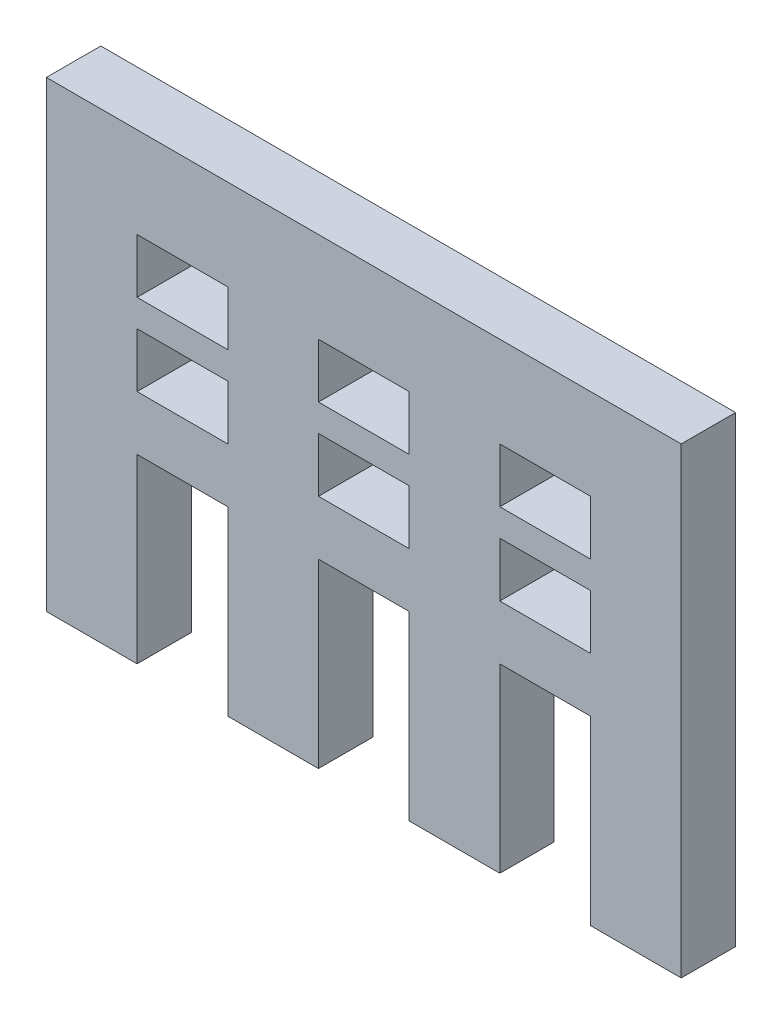
ISO-10303-21;
HEADER;
FILE_DESCRIPTION(('STEP AP214'),'2;1');
FILE_NAME('part.step','',(''),(''),'','','');
FILE_SCHEMA(('AUTOMOTIVE_DESIGN { 1 0 10303 214 1 1 1 1 }'));
ENDSEC;
DATA;
#1=APPLICATION_CONTEXT('core data for automotive mechanical design processes');
#2=APPLICATION_PROTOCOL_DEFINITION('international standard','automotive_design',2000,#1);
#3=PRODUCT_CONTEXT('',#1,'mechanical');
#4=PRODUCT('Part','Part','',(#3));
#5=PRODUCT_RELATED_PRODUCT_CATEGORY('part','',(#4));
#6=PRODUCT_DEFINITION_FORMATION('','',#4);
#7=PRODUCT_DEFINITION_CONTEXT('part definition',#1,'design');
#8=PRODUCT_DEFINITION('design','',#6,#7);
#9=PRODUCT_DEFINITION_SHAPE('','',#8);
#10=(LENGTH_UNIT() NAMED_UNIT(*) SI_UNIT(.MILLI.,.METRE.));
#11=(NAMED_UNIT(*) PLANE_ANGLE_UNIT() SI_UNIT($,.RADIAN.));
#12=(NAMED_UNIT(*) SI_UNIT($,.STERADIAN.) SOLID_ANGLE_UNIT());
#13=UNCERTAINTY_MEASURE_WITH_UNIT(LENGTH_MEASURE(1.E-05),#10,'distance_accuracy_value','');
#14=(GEOMETRIC_REPRESENTATION_CONTEXT(3) GLOBAL_UNCERTAINTY_ASSIGNED_CONTEXT((#13)) GLOBAL_UNIT_ASSIGNED_CONTEXT((#10,
#11,#12)) REPRESENTATION_CONTEXT('',''));
#15=CARTESIAN_POINT('',(0.,0.,0.));
#16=DIRECTION('',(0.,0.,1.));
#17=DIRECTION('',(1.,0.,0.));
#18=AXIS2_PLACEMENT_3D('',#15,#16,#17);
#19=CARTESIAN_POINT('',(0.,6.,3.));
#20=DIRECTION('',(0.,1.,0.));
#21=DIRECTION('',(0.,0.,1.));
#22=AXIS2_PLACEMENT_3D('',#19,#20,#21);
#23=PLANE('',#22);
#24=DIRECTION('',(1.,0.,0.));
#25=VECTOR('',#24,1.);
#26=CARTESIAN_POINT('',(0.,6.,0.));
#27=LINE('',#26,#25);
#28=CARTESIAN_POINT('',(-30.,6.,0.));
#29=VERTEX_POINT('',#28);
#30=CARTESIAN_POINT('',(-25.,6.,0.));
#31=VERTEX_POINT('',#30);
#32=EDGE_CURVE('E577',#29,#31,#27,.T.);
#33=ORIENTED_EDGE('',*,*,#32,.T.);
#34=DIRECTION('',(0.,0.,-1.));
#35=VECTOR('',#34,1.);
#36=CARTESIAN_POINT('',(-25.,6.,3.));
#37=LINE('',#36,#35);
#38=CARTESIAN_POINT('',(-25.,6.,3.));
#39=VERTEX_POINT('',#38);
#40=EDGE_CURVE('E11',#39,#31,#37,.T.);
#41=ORIENTED_EDGE('',*,*,#40,.F.);
#42=DIRECTION('',(1.,0.,0.));
#43=VECTOR('',#42,1.);
#44=CARTESIAN_POINT('',(0.,6.,3.));
#45=LINE('',#44,#43);
#46=CARTESIAN_POINT('',(-30.,6.,3.));
#47=VERTEX_POINT('',#46);
#48=EDGE_CURVE('E312',#47,#39,#45,.T.);
#49=ORIENTED_EDGE('',*,*,#48,.F.);
#50=DIRECTION('',(0.,0.,-1.));
#51=VECTOR('',#50,1.);
#52=CARTESIAN_POINT('',(-30.,6.,3.));
#53=LINE('',#52,#51);
#54=EDGE_CURVE('E408',#47,#29,#53,.T.);
#55=ORIENTED_EDGE('',*,*,#54,.T.);
#56=EDGE_LOOP('',(#33,#41,#49,#55));
#57=FACE_BOUND('',#56,.T.);
#58=ADVANCED_FACE('F35',(#57),#23,.F.);
#59=CARTESIAN_POINT('',(-25.,0.,3.));
#60=DIRECTION('',(-1.,0.,0.));
#61=DIRECTION('',(0.,0.,1.));
#62=AXIS2_PLACEMENT_3D('',#59,#60,#61);
#63=PLANE('',#62);
#64=DIRECTION('',(0.,1.,0.));
#65=VECTOR('',#64,1.);
#66=CARTESIAN_POINT('',(-25.,0.,0.));
#67=LINE('',#66,#65);
#68=CARTESIAN_POINT('',(-25.,3.,0.));
#69=VERTEX_POINT('',#68);
#70=EDGE_CURVE('E303',#69,#31,#67,.T.);
#71=ORIENTED_EDGE('',*,*,#70,.F.);
#72=DIRECTION('',(0.,0.,-1.));
#73=VECTOR('',#72,1.);
#74=CARTESIAN_POINT('',(-25.,3.,3.));
#75=LINE('',#74,#73);
#76=CARTESIAN_POINT('',(-25.,3.,3.));
#77=VERTEX_POINT('',#76);
#78=EDGE_CURVE('E45',#77,#69,#75,.T.);
#79=ORIENTED_EDGE('',*,*,#78,.F.);
#80=DIRECTION('',(0.,1.,0.));
#81=VECTOR('',#80,1.);
#82=CARTESIAN_POINT('',(-25.,0.,3.));
#83=LINE('',#82,#81);
#84=EDGE_CURVE('E301',#77,#39,#83,.T.);
#85=ORIENTED_EDGE('',*,*,#84,.T.);
#86=ORIENTED_EDGE('',*,*,#40,.T.);
#87=EDGE_LOOP('',(#71,#79,#85,#86));
#88=FACE_BOUND('',#87,.T.);
#89=ADVANCED_FACE('F300',(#88),#63,.T.);
#90=CARTESIAN_POINT('',(0.,3.,3.));
#91=DIRECTION('',(0.,1.,0.));
#92=DIRECTION('',(-1.,0.,0.));
#93=AXIS2_PLACEMENT_3D('',#90,#91,#92);
#94=PLANE('',#93);
#95=DIRECTION('',(1.,0.,0.));
#96=VECTOR('',#95,1.);
#97=CARTESIAN_POINT('',(0.,3.,0.));
#98=LINE('',#97,#96);
#99=CARTESIAN_POINT('',(-30.,3.,0.));
#100=VERTEX_POINT('',#99);
#101=EDGE_CURVE('E400',#100,#69,#98,.T.);
#102=ORIENTED_EDGE('',*,*,#101,.F.);
#103=DIRECTION('',(0.,0.,-1.));
#104=VECTOR('',#103,1.);
#105=CARTESIAN_POINT('',(-30.,3.,3.));
#106=LINE('',#105,#104);
#107=CARTESIAN_POINT('',(-30.,3.,3.));
#108=VERTEX_POINT('',#107);
#109=EDGE_CURVE('E177',#108,#100,#106,.T.);
#110=ORIENTED_EDGE('',*,*,#109,.F.);
#111=DIRECTION('',(1.,0.,0.));
#112=VECTOR('',#111,1.);
#113=CARTESIAN_POINT('',(0.,3.,3.));
#114=LINE('',#113,#112);
#115=EDGE_CURVE('E310',#108,#77,#114,.T.);
#116=ORIENTED_EDGE('',*,*,#115,.T.);
#117=ORIENTED_EDGE('',*,*,#78,.T.);
#118=EDGE_LOOP('',(#102,#110,#116,#117));
#119=FACE_BOUND('',#118,.T.);
#120=ADVANCED_FACE('F315',(#119),#94,.T.);
#121=CARTESIAN_POINT('',(-20.,0.,3.));
#122=DIRECTION('',(-1.,0.,0.));
#123=DIRECTION('',(0.,0.,1.));
#124=AXIS2_PLACEMENT_3D('',#121,#122,#123);
#125=PLANE('',#124);
#126=DIRECTION('',(0.,1.,0.));
#127=VECTOR('',#126,1.);
#128=CARTESIAN_POINT('',(-20.,0.,0.));
#129=LINE('',#128,#127);
#130=CARTESIAN_POINT('',(-20.,3.,0.));
#131=VERTEX_POINT('',#130);
#132=CARTESIAN_POINT('',(-20.,6.,0.));
#133=VERTEX_POINT('',#132);
#134=EDGE_CURVE('E582',#131,#133,#129,.T.);
#135=ORIENTED_EDGE('',*,*,#134,.T.);
#136=DIRECTION('',(0.,0.,-1.));
#137=VECTOR('',#136,1.);
#138=CARTESIAN_POINT('',(-20.,6.,3.));
#139=LINE('',#138,#137);
#140=CARTESIAN_POINT('',(-20.,6.,3.));
#141=VERTEX_POINT('',#140);
#142=EDGE_CURVE('E410',#141,#133,#139,.T.);
#143=ORIENTED_EDGE('',*,*,#142,.F.);
#144=DIRECTION('',(0.,1.,0.));
#145=VECTOR('',#144,1.);
#146=CARTESIAN_POINT('',(-20.,0.,3.));
#147=LINE('',#146,#145);
#148=CARTESIAN_POINT('',(-20.,3.,3.));
#149=VERTEX_POINT('',#148);
#150=EDGE_CURVE('E326',#149,#141,#147,.T.);
#151=ORIENTED_EDGE('',*,*,#150,.F.);
#152=DIRECTION('',(0.,0.,-1.));
#153=VECTOR('',#152,1.);
#154=CARTESIAN_POINT('',(-20.,3.,3.));
#155=LINE('',#154,#153);
#156=EDGE_CURVE('E412',#149,#131,#155,.T.);
#157=ORIENTED_EDGE('',*,*,#156,.T.);
#158=EDGE_LOOP('',(#135,#143,#151,#157));
#159=FACE_BOUND('',#158,.T.);
#160=ADVANCED_FACE('F620',(#159),#125,.F.);
#161=CARTESIAN_POINT('',(-15.,6.,0.));
#162=VERTEX_POINT('',#161);
#163=EDGE_CURVE('E578',#133,#162,#27,.T.);
#164=ORIENTED_EDGE('',*,*,#163,.T.);
#165=DIRECTION('',(0.,0.,-1.));
#166=VECTOR('',#165,1.);
#167=CARTESIAN_POINT('',(-15.,6.,3.));
#168=LINE('',#167,#166);
#169=CARTESIAN_POINT('',(-15.,6.,3.));
#170=VERTEX_POINT('',#169);
#171=EDGE_CURVE('E417',#170,#162,#168,.T.);
#172=ORIENTED_EDGE('',*,*,#171,.F.);
#173=EDGE_CURVE('E331',#141,#170,#45,.T.);
#174=ORIENTED_EDGE('',*,*,#173,.F.);
#175=ORIENTED_EDGE('',*,*,#142,.T.);
#176=EDGE_LOOP('',(#164,#172,#174,#175));
#177=FACE_BOUND('',#176,.T.);
#178=ADVANCED_FACE('F608',(#177),#23,.F.);
#179=CARTESIAN_POINT('',(-15.,0.,3.));
#180=DIRECTION('',(-1.,0.,0.));
#181=DIRECTION('',(0.,0.,1.));
#182=AXIS2_PLACEMENT_3D('',#179,#180,#181);
#183=PLANE('',#182);
#184=DIRECTION('',(0.,1.,0.));
#185=VECTOR('',#184,1.);
#186=CARTESIAN_POINT('',(-15.,0.,0.));
#187=LINE('',#186,#185);
#188=CARTESIAN_POINT('',(-15.,3.,0.));
#189=VERTEX_POINT('',#188);
#190=EDGE_CURVE('E584',#189,#162,#187,.T.);
#191=ORIENTED_EDGE('',*,*,#190,.F.);
#192=DIRECTION('',(0.,0.,-1.));
#193=VECTOR('',#192,1.);
#194=CARTESIAN_POINT('',(-15.,3.,3.));
#195=LINE('',#194,#193);
#196=CARTESIAN_POINT('',(-15.,3.,3.));
#197=VERTEX_POINT('',#196);
#198=EDGE_CURVE('E414',#197,#189,#195,.T.);
#199=ORIENTED_EDGE('',*,*,#198,.F.);
#200=DIRECTION('',(0.,1.,0.));
#201=VECTOR('',#200,1.);
#202=CARTESIAN_POINT('',(-15.,0.,3.));
#203=LINE('',#202,#201);
#204=EDGE_CURVE('E324',#197,#170,#203,.T.);
#205=ORIENTED_EDGE('',*,*,#204,.T.);
#206=ORIENTED_EDGE('',*,*,#171,.T.);
#207=EDGE_LOOP('',(#191,#199,#205,#206));
#208=FACE_BOUND('',#207,.T.);
#209=ADVANCED_FACE('F619',(#208),#183,.T.);
#210=CARTESIAN_POINT('',(-10.,0.,3.));
#211=DIRECTION('',(-1.,0.,0.));
#212=DIRECTION('',(0.,0.,1.));
#213=AXIS2_PLACEMENT_3D('',#210,#211,#212);
#214=PLANE('',#213);
#215=DIRECTION('',(0.,1.,0.));
#216=VECTOR('',#215,1.);
#217=CARTESIAN_POINT('',(-10.,0.,0.));
#218=LINE('',#217,#216);
#219=CARTESIAN_POINT('',(-10.,3.,0.));
#220=VERTEX_POINT('',#219);
#221=CARTESIAN_POINT('',(-10.,6.,0.));
#222=VERTEX_POINT('',#221);
#223=EDGE_CURVE('E570',#220,#222,#218,.T.);
#224=ORIENTED_EDGE('',*,*,#223,.T.);
#225=DIRECTION('',(0.,0.,-1.));
#226=VECTOR('',#225,1.);
#227=CARTESIAN_POINT('',(-10.,6.,3.));
#228=LINE('',#227,#226);
#229=CARTESIAN_POINT('',(-10.,6.,3.));
#230=VERTEX_POINT('',#229);
#231=EDGE_CURVE('E415',#230,#222,#228,.T.);
#232=ORIENTED_EDGE('',*,*,#231,.F.);
#233=DIRECTION('',(0.,1.,0.));
#234=VECTOR('',#233,1.);
#235=CARTESIAN_POINT('',(-10.,0.,3.));
#236=LINE('',#235,#234);
#237=CARTESIAN_POINT('',(-10.,3.,3.));
#238=VERTEX_POINT('',#237);
#239=EDGE_CURVE('E336',#238,#230,#236,.T.);
#240=ORIENTED_EDGE('',*,*,#239,.F.);
#241=DIRECTION('',(0.,0.,-1.));
#242=VECTOR('',#241,1.);
#243=CARTESIAN_POINT('',(-10.,3.,3.));
#244=LINE('',#243,#242);
#245=EDGE_CURVE('E421',#238,#220,#244,.T.);
#246=ORIENTED_EDGE('',*,*,#245,.T.);
#247=EDGE_LOOP('',(#224,#232,#240,#246));
#248=FACE_BOUND('',#247,.T.);
#249=ADVANCED_FACE('F616',(#248),#214,.F.);
#250=CARTESIAN_POINT('',(-5.,6.,0.));
#251=VERTEX_POINT('',#250);
#252=EDGE_CURVE('E573',#222,#251,#27,.T.);
#253=ORIENTED_EDGE('',*,*,#252,.T.);
#254=DIRECTION('',(0.,0.,-1.));
#255=VECTOR('',#254,1.);
#256=CARTESIAN_POINT('',(-5.,6.,3.));
#257=LINE('',#256,#255);
#258=CARTESIAN_POINT('',(-5.,6.,3.));
#259=VERTEX_POINT('',#258);
#260=EDGE_CURVE('E426',#259,#251,#257,.T.);
#261=ORIENTED_EDGE('',*,*,#260,.F.);
#262=EDGE_CURVE('E333',#230,#259,#45,.T.);
#263=ORIENTED_EDGE('',*,*,#262,.F.);
#264=ORIENTED_EDGE('',*,*,#231,.T.);
#265=EDGE_LOOP('',(#253,#261,#263,#264));
#266=FACE_BOUND('',#265,.T.);
#267=ADVANCED_FACE('F607',(#266),#23,.F.);
#268=CARTESIAN_POINT('',(-5.,0.,3.));
#269=DIRECTION('',(-1.,0.,0.));
#270=DIRECTION('',(0.,0.,1.));
#271=AXIS2_PLACEMENT_3D('',#268,#269,#270);
#272=PLANE('',#271);
#273=DIRECTION('',(0.,1.,0.));
#274=VECTOR('',#273,1.);
#275=CARTESIAN_POINT('',(-5.,0.,0.));
#276=LINE('',#275,#274);
#277=CARTESIAN_POINT('',(-5.,3.,0.));
#278=VERTEX_POINT('',#277);
#279=EDGE_CURVE('E576',#278,#251,#276,.T.);
#280=ORIENTED_EDGE('',*,*,#279,.F.);
#281=DIRECTION('',(0.,0.,-1.));
#282=VECTOR('',#281,1.);
#283=CARTESIAN_POINT('',(-5.,3.,3.));
#284=LINE('',#283,#282);
#285=CARTESIAN_POINT('',(-5.,3.,3.));
#286=VERTEX_POINT('',#285);
#287=EDGE_CURVE('E423',#286,#278,#284,.T.);
#288=ORIENTED_EDGE('',*,*,#287,.F.);
#289=DIRECTION('',(0.,1.,0.));
#290=VECTOR('',#289,1.);
#291=CARTESIAN_POINT('',(-5.,0.,3.));
#292=LINE('',#291,#290);
#293=EDGE_CURVE('E327',#286,#259,#292,.T.);
#294=ORIENTED_EDGE('',*,*,#293,.T.);
#295=ORIENTED_EDGE('',*,*,#260,.T.);
#296=EDGE_LOOP('',(#280,#288,#294,#295));
#297=FACE_BOUND('',#296,.T.);
#298=ADVANCED_FACE('F615',(#297),#272,.T.);
#299=CARTESIAN_POINT('',(0.,10.5,3.));
#300=DIRECTION('',(0.,1.,0.));
#301=DIRECTION('',(0.,0.,1.));
#302=AXIS2_PLACEMENT_3D('',#299,#300,#301);
#303=PLANE('',#302);
#304=DIRECTION('',(1.,0.,0.));
#305=VECTOR('',#304,1.);
#306=CARTESIAN_POINT('',(0.,10.5,0.));
#307=LINE('',#306,#305);
#308=CARTESIAN_POINT('',(-30.,10.5,0.));
#309=VERTEX_POINT('',#308);
#310=CARTESIAN_POINT('',(-25.,10.5,0.));
#311=VERTEX_POINT('',#310);
#312=EDGE_CURVE('E550',#309,#311,#307,.T.);
#313=ORIENTED_EDGE('',*,*,#312,.T.);
#314=DIRECTION('',(0.,0.,-1.));
#315=VECTOR('',#314,1.);
#316=CARTESIAN_POINT('',(-25.,10.5,3.));
#317=LINE('',#316,#315);
#318=CARTESIAN_POINT('',(-25.,10.5,3.));
#319=VERTEX_POINT('',#318);
#320=EDGE_CURVE('E424',#319,#311,#317,.T.);
#321=ORIENTED_EDGE('',*,*,#320,.F.);
#322=DIRECTION('',(1.,0.,0.));
#323=VECTOR('',#322,1.);
#324=CARTESIAN_POINT('',(0.,10.5,3.));
#325=LINE('',#324,#323);
#326=CARTESIAN_POINT('',(-30.,10.5,3.));
#327=VERTEX_POINT('',#326);
#328=EDGE_CURVE('E347',#327,#319,#325,.T.);
#329=ORIENTED_EDGE('',*,*,#328,.F.);
#330=DIRECTION('',(0.,0.,-1.));
#331=VECTOR('',#330,1.);
#332=CARTESIAN_POINT('',(-30.,10.5,3.));
#333=LINE('',#332,#331);
#334=EDGE_CURVE('E430',#327,#309,#333,.T.);
#335=ORIENTED_EDGE('',*,*,#334,.T.);
#336=EDGE_LOOP('',(#313,#321,#329,#335));
#337=FACE_BOUND('',#336,.T.);
#338=ADVANCED_FACE('F637',(#337),#303,.F.);
#339=CARTESIAN_POINT('',(-25.,0.,3.));
#340=DIRECTION('',(-1.,0.,0.));
#341=DIRECTION('',(0.,0.,1.));
#342=AXIS2_PLACEMENT_3D('',#339,#340,#341);
#343=PLANE('',#342);
#344=DIRECTION('',(0.,1.,0.));
#345=VECTOR('',#344,1.);
#346=CARTESIAN_POINT('',(-25.,0.,0.));
#347=LINE('',#346,#345);
#348=CARTESIAN_POINT('',(-25.,7.5,0.));
#349=VERTEX_POINT('',#348);
#350=EDGE_CURVE('E565',#349,#311,#347,.T.);
#351=ORIENTED_EDGE('',*,*,#350,.F.);
#352=DIRECTION('',(0.,0.,-1.));
#353=VECTOR('',#352,1.);
#354=CARTESIAN_POINT('',(-25.,7.5,3.));
#355=LINE('',#354,#353);
#356=CARTESIAN_POINT('',(-25.,7.5,3.));
#357=VERTEX_POINT('',#356);
#358=EDGE_CURVE('E436',#357,#349,#355,.T.);
#359=ORIENTED_EDGE('',*,*,#358,.F.);
#360=DIRECTION('',(0.,1.,0.));
#361=VECTOR('',#360,1.);
#362=CARTESIAN_POINT('',(-25.,0.,3.));
#363=LINE('',#362,#361);
#364=EDGE_CURVE('E344',#357,#319,#363,.T.);
#365=ORIENTED_EDGE('',*,*,#364,.T.);
#366=ORIENTED_EDGE('',*,*,#320,.T.);
#367=EDGE_LOOP('',(#351,#359,#365,#366));
#368=FACE_BOUND('',#367,.T.);
#369=ADVANCED_FACE('F650',(#368),#343,.T.);
#370=CARTESIAN_POINT('',(0.,7.5,3.));
#371=DIRECTION('',(0.,1.,0.));
#372=DIRECTION('',(0.,0.,1.));
#373=AXIS2_PLACEMENT_3D('',#370,#371,#372);
#374=PLANE('',#373);
#375=DIRECTION('',(1.,0.,0.));
#376=VECTOR('',#375,1.);
#377=CARTESIAN_POINT('',(0.,7.5,0.));
#378=LINE('',#377,#376);
#379=CARTESIAN_POINT('',(-30.,7.5,0.));
#380=VERTEX_POINT('',#379);
#381=EDGE_CURVE('E558',#380,#349,#378,.T.);
#382=ORIENTED_EDGE('',*,*,#381,.F.);
#383=DIRECTION('',(0.,0.,-1.));
#384=VECTOR('',#383,1.);
#385=CARTESIAN_POINT('',(-30.,7.5,3.));
#386=LINE('',#385,#384);
#387=CARTESIAN_POINT('',(-30.,7.5,3.));
#388=VERTEX_POINT('',#387);
#389=EDGE_CURVE('E433',#388,#380,#386,.T.);
#390=ORIENTED_EDGE('',*,*,#389,.F.);
#391=DIRECTION('',(1.,0.,0.));
#392=VECTOR('',#391,1.);
#393=CARTESIAN_POINT('',(0.,7.5,3.));
#394=LINE('',#393,#392);
#395=EDGE_CURVE('E343',#388,#357,#394,.T.);
#396=ORIENTED_EDGE('',*,*,#395,.T.);
#397=ORIENTED_EDGE('',*,*,#358,.T.);
#398=EDGE_LOOP('',(#382,#390,#396,#397));
#399=FACE_BOUND('',#398,.T.);
#400=ADVANCED_FACE('F646',(#399),#374,.T.);
#401=CARTESIAN_POINT('',(-20.,0.,3.));
#402=DIRECTION('',(-1.,0.,0.));
#403=DIRECTION('',(0.,0.,1.));
#404=AXIS2_PLACEMENT_3D('',#401,#402,#403);
#405=PLANE('',#404);
#406=DIRECTION('',(0.,1.,0.));
#407=VECTOR('',#406,1.);
#408=CARTESIAN_POINT('',(-20.,0.,0.));
#409=LINE('',#408,#407);
#410=CARTESIAN_POINT('',(-20.,7.5,0.));
#411=VERTEX_POINT('',#410);
#412=CARTESIAN_POINT('',(-20.,10.5,0.));
#413=VERTEX_POINT('',#412);
#414=EDGE_CURVE('E557',#411,#413,#409,.T.);
#415=ORIENTED_EDGE('',*,*,#414,.T.);
#416=DIRECTION('',(0.,0.,-1.));
#417=VECTOR('',#416,1.);
#418=CARTESIAN_POINT('',(-20.,10.5,3.));
#419=LINE('',#418,#417);
#420=CARTESIAN_POINT('',(-20.,10.5,3.));
#421=VERTEX_POINT('',#420);
#422=EDGE_CURVE('E434',#421,#413,#419,.T.);
#423=ORIENTED_EDGE('',*,*,#422,.F.);
#424=DIRECTION('',(0.,1.,0.));
#425=VECTOR('',#424,1.);
#426=CARTESIAN_POINT('',(-20.,0.,3.));
#427=LINE('',#426,#425);
#428=CARTESIAN_POINT('',(-20.,7.5,3.));
#429=VERTEX_POINT('',#428);
#430=EDGE_CURVE('E353',#429,#421,#427,.T.);
#431=ORIENTED_EDGE('',*,*,#430,.F.);
#432=DIRECTION('',(0.,0.,-1.));
#433=VECTOR('',#432,1.);
#434=CARTESIAN_POINT('',(-20.,7.5,3.));
#435=LINE('',#434,#433);
#436=EDGE_CURVE('E439',#429,#411,#435,.T.);
#437=ORIENTED_EDGE('',*,*,#436,.T.);
#438=EDGE_LOOP('',(#415,#423,#431,#437));
#439=FACE_BOUND('',#438,.T.);
#440=ADVANCED_FACE('F649',(#439),#405,.F.);
#441=CARTESIAN_POINT('',(-15.,10.5,0.));
#442=VERTEX_POINT('',#441);
#443=EDGE_CURVE('E551',#413,#442,#307,.T.);
#444=ORIENTED_EDGE('',*,*,#443,.T.);
#445=DIRECTION('',(0.,0.,-1.));
#446=VECTOR('',#445,1.);
#447=CARTESIAN_POINT('',(-15.,10.5,3.));
#448=LINE('',#447,#446);
#449=CARTESIAN_POINT('',(-15.,10.5,3.));
#450=VERTEX_POINT('',#449);
#451=EDGE_CURVE('E444',#450,#442,#448,.T.);
#452=ORIENTED_EDGE('',*,*,#451,.F.);
#453=EDGE_CURVE('E352',#421,#450,#325,.T.);
#454=ORIENTED_EDGE('',*,*,#453,.F.);
#455=ORIENTED_EDGE('',*,*,#422,.T.);
#456=EDGE_LOOP('',(#444,#452,#454,#455));
#457=FACE_BOUND('',#456,.T.);
#458=ADVANCED_FACE('F660',(#457),#303,.F.);
#459=CARTESIAN_POINT('',(-15.,0.,3.));
#460=DIRECTION('',(-1.,0.,0.));
#461=DIRECTION('',(0.,0.,1.));
#462=AXIS2_PLACEMENT_3D('',#459,#460,#461);
#463=PLANE('',#462);
#464=DIRECTION('',(0.,1.,0.));
#465=VECTOR('',#464,1.);
#466=CARTESIAN_POINT('',(-15.,0.,0.));
#467=LINE('',#466,#465);
#468=CARTESIAN_POINT('',(-15.,7.5,0.));
#469=VERTEX_POINT('',#468);
#470=EDGE_CURVE('E562',#469,#442,#467,.T.);
#471=ORIENTED_EDGE('',*,*,#470,.F.);
#472=DIRECTION('',(0.,0.,-1.));
#473=VECTOR('',#472,1.);
#474=CARTESIAN_POINT('',(-15.,7.5,3.));
#475=LINE('',#474,#473);
#476=CARTESIAN_POINT('',(-15.,7.5,3.));
#477=VERTEX_POINT('',#476);
#478=EDGE_CURVE('E441',#477,#469,#475,.T.);
#479=ORIENTED_EDGE('',*,*,#478,.F.);
#480=DIRECTION('',(0.,1.,0.));
#481=VECTOR('',#480,1.);
#482=CARTESIAN_POINT('',(-15.,0.,3.));
#483=LINE('',#482,#481);
#484=EDGE_CURVE('E348',#477,#450,#483,.T.);
#485=ORIENTED_EDGE('',*,*,#484,.T.);
#486=ORIENTED_EDGE('',*,*,#451,.T.);
#487=EDGE_LOOP('',(#471,#479,#485,#486));
#488=FACE_BOUND('',#487,.T.);
#489=ADVANCED_FACE('F661',(#488),#463,.T.);
#490=CARTESIAN_POINT('',(-10.,0.,3.));
#491=DIRECTION('',(-1.,0.,0.));
#492=DIRECTION('',(0.,0.,1.));
#493=AXIS2_PLACEMENT_3D('',#490,#491,#492);
#494=PLANE('',#493);
#495=DIRECTION('',(0.,1.,0.));
#496=VECTOR('',#495,1.);
#497=CARTESIAN_POINT('',(-10.,0.,0.));
#498=LINE('',#497,#496);
#499=CARTESIAN_POINT('',(-10.,7.5,0.));
#500=VERTEX_POINT('',#499);
#501=CARTESIAN_POINT('',(-10.,10.5,0.));
#502=VERTEX_POINT('',#501);
#503=EDGE_CURVE('E543',#500,#502,#498,.T.);
#504=ORIENTED_EDGE('',*,*,#503,.T.);
#505=DIRECTION('',(0.,0.,-1.));
#506=VECTOR('',#505,1.);
#507=CARTESIAN_POINT('',(-10.,10.5,3.));
#508=LINE('',#507,#506);
#509=CARTESIAN_POINT('',(-10.,10.5,3.));
#510=VERTEX_POINT('',#509);
#511=EDGE_CURVE('E442',#510,#502,#508,.T.);
#512=ORIENTED_EDGE('',*,*,#511,.F.);
#513=DIRECTION('',(0.,1.,0.));
#514=VECTOR('',#513,1.);
#515=CARTESIAN_POINT('',(-10.,0.,3.));
#516=LINE('',#515,#514);
#517=CARTESIAN_POINT('',(-10.,7.5,3.));
#518=VERTEX_POINT('',#517);
#519=EDGE_CURVE('E364',#518,#510,#516,.T.);
#520=ORIENTED_EDGE('',*,*,#519,.F.);
#521=DIRECTION('',(0.,0.,-1.));
#522=VECTOR('',#521,1.);
#523=CARTESIAN_POINT('',(-10.,7.5,3.));
#524=LINE('',#523,#522);
#525=EDGE_CURVE('E448',#518,#500,#524,.T.);
#526=ORIENTED_EDGE('',*,*,#525,.T.);
#527=EDGE_LOOP('',(#504,#512,#520,#526));
#528=FACE_BOUND('',#527,.T.);
#529=ADVANCED_FACE('F664',(#528),#494,.F.);
#530=CARTESIAN_POINT('',(-5.,10.5,0.));
#531=VERTEX_POINT('',#530);
#532=EDGE_CURVE('E546',#502,#531,#307,.T.);
#533=ORIENTED_EDGE('',*,*,#532,.T.);
#534=DIRECTION('',(0.,0.,-1.));
#535=VECTOR('',#534,1.);
#536=CARTESIAN_POINT('',(-5.,10.5,3.));
#537=LINE('',#536,#535);
#538=CARTESIAN_POINT('',(-5.,10.5,3.));
#539=VERTEX_POINT('',#538);
#540=EDGE_CURVE('E452',#539,#531,#537,.T.);
#541=ORIENTED_EDGE('',*,*,#540,.F.);
#542=EDGE_CURVE('E362',#510,#539,#325,.T.);
#543=ORIENTED_EDGE('',*,*,#542,.F.);
#544=ORIENTED_EDGE('',*,*,#511,.T.);
#545=EDGE_LOOP('',(#533,#541,#543,#544));
#546=FACE_BOUND('',#545,.T.);
#547=ADVANCED_FACE('F659',(#546),#303,.F.);
#548=CARTESIAN_POINT('',(-5.,0.,3.));
#549=DIRECTION('',(-1.,0.,0.));
#550=DIRECTION('',(0.,0.,1.));
#551=AXIS2_PLACEMENT_3D('',#548,#549,#550);
#552=PLANE('',#551);
#553=DIRECTION('',(0.,1.,0.));
#554=VECTOR('',#553,1.);
#555=CARTESIAN_POINT('',(-5.,0.,0.));
#556=LINE('',#555,#554);
#557=CARTESIAN_POINT('',(-5.,7.5,0.));
#558=VERTEX_POINT('',#557);
#559=EDGE_CURVE('E549',#558,#531,#556,.T.);
#560=ORIENTED_EDGE('',*,*,#559,.F.);
#561=DIRECTION('',(0.,0.,-1.));
#562=VECTOR('',#561,1.);
#563=CARTESIAN_POINT('',(-5.,7.5,3.));
#564=LINE('',#563,#562);
#565=CARTESIAN_POINT('',(-5.,7.5,3.));
#566=VERTEX_POINT('',#565);
#567=EDGE_CURVE('E450',#566,#558,#564,.T.);
#568=ORIENTED_EDGE('',*,*,#567,.F.);
#569=DIRECTION('',(0.,1.,0.));
#570=VECTOR('',#569,1.);
#571=CARTESIAN_POINT('',(-5.,0.,3.));
#572=LINE('',#571,#570);
#573=EDGE_CURVE('E359',#566,#539,#572,.T.);
#574=ORIENTED_EDGE('',*,*,#573,.T.);
#575=ORIENTED_EDGE('',*,*,#540,.T.);
#576=EDGE_LOOP('',(#560,#568,#574,#575));
#577=FACE_BOUND('',#576,.T.);
#578=ADVANCED_FACE('F669',(#577),#552,.T.);
#579=CARTESIAN_POINT('',(0.,0.,3.));
#580=DIRECTION('',(1.,0.,0.));
#581=DIRECTION('',(0.,1.,0.));
#582=AXIS2_PLACEMENT_3D('',#579,#580,#581);
#583=PLANE('',#582);
#584=DIRECTION('',(0.,-1.,0.));
#585=VECTOR('',#584,1.);
#586=CARTESIAN_POINT('',(0.,0.,0.));
#587=LINE('',#586,#585);
#588=CARTESIAN_POINT('',(0.,15.5,0.));
#589=VERTEX_POINT('',#588);
#590=CARTESIAN_POINT('',(0.,-10.,0.));
#591=VERTEX_POINT('',#590);
#592=EDGE_CURVE('E500',#589,#591,#587,.T.);
#593=ORIENTED_EDGE('',*,*,#592,.F.);
#594=DIRECTION('',(0.,0.,-1.));
#595=VECTOR('',#594,1.);
#596=CARTESIAN_POINT('',(0.,15.5,3.));
#597=LINE('',#596,#595);
#598=CARTESIAN_POINT('',(0.,15.5,3.));
#599=VERTEX_POINT('',#598);
#600=EDGE_CURVE('E39',#599,#589,#597,.T.);
#601=ORIENTED_EDGE('',*,*,#600,.F.);
#602=DIRECTION('',(0.,-1.,0.));
#603=VECTOR('',#602,1.);
#604=CARTESIAN_POINT('',(0.,0.,3.));
#605=LINE('',#604,#603);
#606=CARTESIAN_POINT('',(0.,-10.,3.));
#607=VERTEX_POINT('',#606);
#608=EDGE_CURVE('E399',#599,#607,#605,.T.);
#609=ORIENTED_EDGE('',*,*,#608,.T.);
#610=DIRECTION('',(0.,0.,-1.));
#611=VECTOR('',#610,1.);
#612=CARTESIAN_POINT('',(0.,-10.,3.));
#613=LINE('',#612,#611);
#614=EDGE_CURVE('E319',#607,#591,#613,.T.);
#615=ORIENTED_EDGE('',*,*,#614,.T.);
#616=EDGE_LOOP('',(#593,#601,#609,#615));
#617=FACE_BOUND('',#616,.T.);
#618=ADVANCED_FACE('F37',(#617),#583,.T.);
#619=CARTESIAN_POINT('',(0.,15.5,3.));
#620=DIRECTION('',(0.,1.,0.));
#621=DIRECTION('',(0.,0.,1.));
#622=AXIS2_PLACEMENT_3D('',#619,#620,#621);
#623=PLANE('',#622);
#624=DIRECTION('',(1.,0.,0.));
#625=VECTOR('',#624,1.);
#626=CARTESIAN_POINT('',(0.,15.5,0.));
#627=LINE('',#626,#625);
#628=CARTESIAN_POINT('',(-35.,15.5,0.));
#629=VERTEX_POINT('',#628);
#630=EDGE_CURVE('E497',#629,#589,#627,.T.);
#631=ORIENTED_EDGE('',*,*,#630,.F.);
#632=DIRECTION('',(0.,0.,-1.));
#633=VECTOR('',#632,1.);
#634=CARTESIAN_POINT('',(-35.,15.5,3.));
#635=LINE('',#634,#633);
#636=CARTESIAN_POINT('',(-35.,15.5,3.));
#637=VERTEX_POINT('',#636);
#638=EDGE_CURVE('E489',#637,#629,#635,.T.);
#639=ORIENTED_EDGE('',*,*,#638,.F.);
#640=DIRECTION('',(1.,0.,0.));
#641=VECTOR('',#640,1.);
#642=CARTESIAN_POINT('',(0.,15.5,3.));
#643=LINE('',#642,#641);
#644=EDGE_CURVE('E396',#637,#599,#643,.T.);
#645=ORIENTED_EDGE('',*,*,#644,.T.);
#646=ORIENTED_EDGE('',*,*,#600,.T.);
#647=EDGE_LOOP('',(#631,#639,#645,#646));
#648=FACE_BOUND('',#647,.T.);
#649=ADVANCED_FACE('F495',(#648),#623,.T.);
#650=CARTESIAN_POINT('',(-35.,0.,3.));
#651=DIRECTION('',(1.,0.,0.));
#652=DIRECTION('',(0.,1.,0.));
#653=AXIS2_PLACEMENT_3D('',#650,#651,#652);
#654=PLANE('',#653);
#655=DIRECTION('',(0.,-1.,0.));
#656=VECTOR('',#655,1.);
#657=CARTESIAN_POINT('',(-35.,0.,0.));
#658=LINE('',#657,#656);
#659=CARTESIAN_POINT('',(-35.,-10.,0.));
#660=VERTEX_POINT('',#659);
#661=EDGE_CURVE('E509',#629,#660,#658,.T.);
#662=ORIENTED_EDGE('',*,*,#661,.T.);
#663=DIRECTION('',(0.,0.,-1.));
#664=VECTOR('',#663,1.);
#665=CARTESIAN_POINT('',(-35.,-10.,3.));
#666=LINE('',#665,#664);
#667=CARTESIAN_POINT('',(-35.,-10.,3.));
#668=VERTEX_POINT('',#667);
#669=EDGE_CURVE('E487',#668,#660,#666,.T.);
#670=ORIENTED_EDGE('',*,*,#669,.F.);
#671=DIRECTION('',(0.,-1.,0.));
#672=VECTOR('',#671,1.);
#673=CARTESIAN_POINT('',(-35.,0.,3.));
#674=LINE('',#673,#672);
#675=EDGE_CURVE('E394',#637,#668,#674,.T.);
#676=ORIENTED_EDGE('',*,*,#675,.F.);
#677=ORIENTED_EDGE('',*,*,#638,.T.);
#678=EDGE_LOOP('',(#662,#670,#676,#677));
#679=FACE_BOUND('',#678,.T.);
#680=ADVANCED_FACE('F721',(#679),#654,.F.);
#681=CARTESIAN_POINT('',(0.,-10.,3.));
#682=DIRECTION('',(0.,1.,0.));
#683=DIRECTION('',(0.,0.,1.));
#684=AXIS2_PLACEMENT_3D('',#681,#682,#683);
#685=PLANE('',#684);
#686=DIRECTION('',(1.,0.,0.));
#687=VECTOR('',#686,1.);
#688=CARTESIAN_POINT('',(0.,-10.,0.));
#689=LINE('',#688,#687);
#690=CARTESIAN_POINT('',(-30.,-10.,0.));
#691=VERTEX_POINT('',#690);
#692=EDGE_CURVE('E511',#660,#691,#689,.T.);
#693=ORIENTED_EDGE('',*,*,#692,.T.);
#694=DIRECTION('',(0.,0.,-1.));
#695=VECTOR('',#694,1.);
#696=CARTESIAN_POINT('',(-30.,-10.,3.));
#697=LINE('',#696,#695);
#698=CARTESIAN_POINT('',(-30.,-10.,3.));
#699=VERTEX_POINT('',#698);
#700=EDGE_CURVE('E485',#699,#691,#697,.T.);
#701=ORIENTED_EDGE('',*,*,#700,.F.);
#702=DIRECTION('',(1.,0.,0.));
#703=VECTOR('',#702,1.);
#704=CARTESIAN_POINT('',(0.,-10.,3.));
#705=LINE('',#704,#703);
#706=EDGE_CURVE('E392',#668,#699,#705,.T.);
#707=ORIENTED_EDGE('',*,*,#706,.F.);
#708=ORIENTED_EDGE('',*,*,#669,.T.);
#709=EDGE_LOOP('',(#693,#701,#707,#708));
#710=FACE_BOUND('',#709,.T.);
#711=ADVANCED_FACE('F717',(#710),#685,.F.);
#712=CARTESIAN_POINT('',(-30.,0.,3.));
#713=DIRECTION('',(1.,0.,0.));
#714=DIRECTION('',(0.,0.,-1.));
#715=AXIS2_PLACEMENT_3D('',#712,#713,#714);
#716=PLANE('',#715);
#717=DIRECTION('',(0.,-1.,0.));
#718=VECTOR('',#717,1.);
#719=CARTESIAN_POINT('',(-30.,0.,0.));
#720=LINE('',#719,#718);
#721=CARTESIAN_POINT('',(-30.,0.,0.));
#722=VERTEX_POINT('',#721);
#723=EDGE_CURVE('E516',#722,#691,#720,.T.);
#724=ORIENTED_EDGE('',*,*,#723,.F.);
#725=DIRECTION('',(0.,0.,-1.));
#726=VECTOR('',#725,1.);
#727=CARTESIAN_POINT('',(-30.,0.,3.));
#728=LINE('',#727,#726);
#729=CARTESIAN_POINT('',(-30.,0.,3.));
#730=VERTEX_POINT('',#729);
#731=EDGE_CURVE('E483',#730,#722,#728,.T.);
#732=ORIENTED_EDGE('',*,*,#731,.F.);
#733=DIRECTION('',(0.,-1.,0.));
#734=VECTOR('',#733,1.);
#735=CARTESIAN_POINT('',(-30.,0.,3.));
#736=LINE('',#735,#734);
#737=EDGE_CURVE('E389',#730,#699,#736,.T.);
#738=ORIENTED_EDGE('',*,*,#737,.T.);
#739=ORIENTED_EDGE('',*,*,#700,.T.);
#740=EDGE_LOOP('',(#724,#732,#738,#739));
#741=FACE_BOUND('',#740,.T.);
#742=ADVANCED_FACE('F714',(#741),#716,.T.);
#743=CARTESIAN_POINT('',(0.,0.,3.));
#744=DIRECTION('',(0.,1.,0.));
#745=DIRECTION('',(0.,0.,1.));
#746=AXIS2_PLACEMENT_3D('',#743,#744,#745);
#747=PLANE('',#746);
#748=DIRECTION('',(1.,0.,0.));
#749=VECTOR('',#748,1.);
#750=CARTESIAN_POINT('',(0.,0.,0.));
#751=LINE('',#750,#749);
#752=CARTESIAN_POINT('',(-25.,0.,0.));
#753=VERTEX_POINT('',#752);
#754=EDGE_CURVE('E519',#722,#753,#751,.T.);
#755=ORIENTED_EDGE('',*,*,#754,.T.);
#756=DIRECTION('',(0.,0.,-1.));
#757=VECTOR('',#756,1.);
#758=CARTESIAN_POINT('',(-25.,0.,3.));
#759=LINE('',#758,#757);
#760=CARTESIAN_POINT('',(-25.,0.,3.));
#761=VERTEX_POINT('',#760);
#762=EDGE_CURVE('E480',#761,#753,#759,.T.);
#763=ORIENTED_EDGE('',*,*,#762,.F.);
#764=DIRECTION('',(1.,0.,0.));
#765=VECTOR('',#764,1.);
#766=CARTESIAN_POINT('',(0.,0.,3.));
#767=LINE('',#766,#765);
#768=EDGE_CURVE('E387',#730,#761,#767,.T.);
#769=ORIENTED_EDGE('',*,*,#768,.F.);
#770=ORIENTED_EDGE('',*,*,#731,.T.);
#771=EDGE_LOOP('',(#755,#763,#769,#770));
#772=FACE_BOUND('',#771,.T.);
#773=ADVANCED_FACE('F689',(#772),#747,.F.);
#774=CARTESIAN_POINT('',(-25.,0.,3.));
#775=DIRECTION('',(1.,0.,0.));
#776=DIRECTION('',(0.,1.,0.));
#777=AXIS2_PLACEMENT_3D('',#774,#775,#776);
#778=PLANE('',#777);
#779=DIRECTION('',(0.,-1.,0.));
#780=VECTOR('',#779,1.);
#781=CARTESIAN_POINT('',(-25.,0.,0.));
#782=LINE('',#781,#780);
#783=CARTESIAN_POINT('',(-25.,-10.,0.));
#784=VERTEX_POINT('',#783);
#785=EDGE_CURVE('E521',#753,#784,#782,.T.);
#786=ORIENTED_EDGE('',*,*,#785,.T.);
#787=DIRECTION('',(0.,0.,-1.));
#788=VECTOR('',#787,1.);
#789=CARTESIAN_POINT('',(-25.,-10.,3.));
#790=LINE('',#789,#788);
#791=CARTESIAN_POINT('',(-25.,-10.,3.));
#792=VERTEX_POINT('',#791);
#793=EDGE_CURVE('E477',#792,#784,#790,.T.);
#794=ORIENTED_EDGE('',*,*,#793,.F.);
#795=DIRECTION('',(0.,-1.,0.));
#796=VECTOR('',#795,1.);
#797=CARTESIAN_POINT('',(-25.,0.,3.));
#798=LINE('',#797,#796);
#799=EDGE_CURVE('E385',#761,#792,#798,.T.);
#800=ORIENTED_EDGE('',*,*,#799,.F.);
#801=ORIENTED_EDGE('',*,*,#762,.T.);
#802=EDGE_LOOP('',(#786,#794,#800,#801));
#803=FACE_BOUND('',#802,.T.);
#804=ADVANCED_FACE('F709',(#803),#778,.F.);
#805=CARTESIAN_POINT('',(0.,-10.,3.));
#806=DIRECTION('',(0.,1.,0.));
#807=DIRECTION('',(0.,0.,1.));
#808=AXIS2_PLACEMENT_3D('',#805,#806,#807);
#809=PLANE('',#808);
#810=DIRECTION('',(1.,0.,0.));
#811=VECTOR('',#810,1.);
#812=CARTESIAN_POINT('',(0.,-10.,0.));
#813=LINE('',#812,#811);
#814=CARTESIAN_POINT('',(-20.,-10.,0.));
#815=VERTEX_POINT('',#814);
#816=EDGE_CURVE('E525',#784,#815,#813,.T.);
#817=ORIENTED_EDGE('',*,*,#816,.T.);
#818=DIRECTION('',(0.,0.,-1.));
#819=VECTOR('',#818,1.);
#820=CARTESIAN_POINT('',(-20.,-10.,3.));
#821=LINE('',#820,#819);
#822=CARTESIAN_POINT('',(-20.,-10.,3.));
#823=VERTEX_POINT('',#822);
#824=EDGE_CURVE('E475',#823,#815,#821,.T.);
#825=ORIENTED_EDGE('',*,*,#824,.F.);
#826=DIRECTION('',(1.,0.,0.));
#827=VECTOR('',#826,1.);
#828=CARTESIAN_POINT('',(0.,-10.,3.));
#829=LINE('',#828,#827);
#830=EDGE_CURVE('E383',#792,#823,#829,.T.);
#831=ORIENTED_EDGE('',*,*,#830,.F.);
#832=ORIENTED_EDGE('',*,*,#793,.T.);
#833=EDGE_LOOP('',(#817,#825,#831,#832));
#834=FACE_BOUND('',#833,.T.);
#835=ADVANCED_FACE('F705',(#834),#809,.F.);
#836=CARTESIAN_POINT('',(-20.,0.,3.));
#837=DIRECTION('',(1.,0.,0.));
#838=DIRECTION('',(0.,0.,-1.));
#839=AXIS2_PLACEMENT_3D('',#836,#837,#838);
#840=PLANE('',#839);
#841=DIRECTION('',(0.,-1.,0.));
#842=VECTOR('',#841,1.);
#843=CARTESIAN_POINT('',(-20.,0.,0.));
#844=LINE('',#843,#842);
#845=CARTESIAN_POINT('',(-20.,0.,0.));
#846=VERTEX_POINT('',#845);
#847=EDGE_CURVE('E528',#846,#815,#844,.T.);
#848=ORIENTED_EDGE('',*,*,#847,.F.);
#849=DIRECTION('',(0.,0.,-1.));
#850=VECTOR('',#849,1.);
#851=CARTESIAN_POINT('',(-20.,0.,3.));
#852=LINE('',#851,#850);
#853=CARTESIAN_POINT('',(-20.,0.,3.));
#854=VERTEX_POINT('',#853);
#855=EDGE_CURVE('E473',#854,#846,#852,.T.);
#856=ORIENTED_EDGE('',*,*,#855,.F.);
#857=DIRECTION('',(0.,-1.,0.));
#858=VECTOR('',#857,1.);
#859=CARTESIAN_POINT('',(-20.,0.,3.));
#860=LINE('',#859,#858);
#861=EDGE_CURVE('E380',#854,#823,#860,.T.);
#862=ORIENTED_EDGE('',*,*,#861,.T.);
#863=ORIENTED_EDGE('',*,*,#824,.T.);
#864=EDGE_LOOP('',(#848,#856,#862,#863));
#865=FACE_BOUND('',#864,.T.);
#866=ADVANCED_FACE('F702',(#865),#840,.T.);
#867=CARTESIAN_POINT('',(-15.,0.,0.));
#868=VERTEX_POINT('',#867);
#869=EDGE_CURVE('E523',#846,#868,#751,.T.);
#870=ORIENTED_EDGE('',*,*,#869,.T.);
#871=DIRECTION('',(0.,0.,-1.));
#872=VECTOR('',#871,1.);
#873=CARTESIAN_POINT('',(-15.,0.,3.));
#874=LINE('',#873,#872);
#875=CARTESIAN_POINT('',(-15.,0.,3.));
#876=VERTEX_POINT('',#875);
#877=EDGE_CURVE('E470',#876,#868,#874,.T.);
#878=ORIENTED_EDGE('',*,*,#877,.F.);
#879=EDGE_CURVE('E379',#854,#876,#767,.T.);
#880=ORIENTED_EDGE('',*,*,#879,.F.);
#881=ORIENTED_EDGE('',*,*,#855,.T.);
#882=EDGE_LOOP('',(#870,#878,#880,#881));
#883=FACE_BOUND('',#882,.T.);
#884=ADVANCED_FACE('F690',(#883),#747,.F.);
#885=CARTESIAN_POINT('',(-15.,0.,3.));
#886=DIRECTION('',(1.,0.,0.));
#887=DIRECTION('',(0.,1.,0.));
#888=AXIS2_PLACEMENT_3D('',#885,#886,#887);
#889=PLANE('',#888);
#890=DIRECTION('',(0.,-1.,0.));
#891=VECTOR('',#890,1.);
#892=CARTESIAN_POINT('',(-15.,0.,0.));
#893=LINE('',#892,#891);
#894=CARTESIAN_POINT('',(-15.,-10.,0.));
#895=VERTEX_POINT('',#894);
#896=EDGE_CURVE('E531',#868,#895,#893,.T.);
#897=ORIENTED_EDGE('',*,*,#896,.T.);
#898=DIRECTION('',(0.,0.,-1.));
#899=VECTOR('',#898,1.);
#900=CARTESIAN_POINT('',(-15.,-10.,3.));
#901=LINE('',#900,#899);
#902=CARTESIAN_POINT('',(-15.,-10.,3.));
#903=VERTEX_POINT('',#902);
#904=EDGE_CURVE('E467',#903,#895,#901,.T.);
#905=ORIENTED_EDGE('',*,*,#904,.F.);
#906=DIRECTION('',(0.,-1.,0.));
#907=VECTOR('',#906,1.);
#908=CARTESIAN_POINT('',(-15.,0.,3.));
#909=LINE('',#908,#907);
#910=EDGE_CURVE('E377',#876,#903,#909,.T.);
#911=ORIENTED_EDGE('',*,*,#910,.F.);
#912=ORIENTED_EDGE('',*,*,#877,.T.);
#913=EDGE_LOOP('',(#897,#905,#911,#912));
#914=FACE_BOUND('',#913,.T.);
#915=ADVANCED_FACE('F697',(#914),#889,.F.);
#916=CARTESIAN_POINT('',(0.,-10.,3.));
#917=DIRECTION('',(0.,1.,0.));
#918=DIRECTION('',(0.,0.,1.));
#919=AXIS2_PLACEMENT_3D('',#916,#917,#918);
#920=PLANE('',#919);
#921=DIRECTION('',(1.,0.,0.));
#922=VECTOR('',#921,1.);
#923=CARTESIAN_POINT('',(0.,-10.,0.));
#924=LINE('',#923,#922);
#925=CARTESIAN_POINT('',(-10.,-10.,0.));
#926=VERTEX_POINT('',#925);
#927=EDGE_CURVE('E533',#895,#926,#924,.T.);
#928=ORIENTED_EDGE('',*,*,#927,.T.);
#929=DIRECTION('',(0.,0.,-1.));
#930=VECTOR('',#929,1.);
#931=CARTESIAN_POINT('',(-10.,-10.,3.));
#932=LINE('',#931,#930);
#933=CARTESIAN_POINT('',(-10.,-10.,3.));
#934=VERTEX_POINT('',#933);
#935=EDGE_CURVE('E465',#934,#926,#932,.T.);
#936=ORIENTED_EDGE('',*,*,#935,.F.);
#937=DIRECTION('',(1.,0.,0.));
#938=VECTOR('',#937,1.);
#939=CARTESIAN_POINT('',(0.,-10.,3.));
#940=LINE('',#939,#938);
#941=EDGE_CURVE('E375',#903,#934,#940,.T.);
#942=ORIENTED_EDGE('',*,*,#941,.F.);
#943=ORIENTED_EDGE('',*,*,#904,.T.);
#944=EDGE_LOOP('',(#928,#936,#942,#943));
#945=FACE_BOUND('',#944,.T.);
#946=ADVANCED_FACE('F693',(#945),#920,.F.);
#947=CARTESIAN_POINT('',(-10.,0.,3.));
#948=DIRECTION('',(1.,0.,0.));
#949=DIRECTION('',(0.,0.,-1.));
#950=AXIS2_PLACEMENT_3D('',#947,#948,#949);
#951=PLANE('',#950);
#952=DIRECTION('',(0.,-1.,0.));
#953=VECTOR('',#952,1.);
#954=CARTESIAN_POINT('',(-10.,0.,0.));
#955=LINE('',#954,#953);
#956=CARTESIAN_POINT('',(-10.,0.,0.));
#957=VERTEX_POINT('',#956);
#958=EDGE_CURVE('E536',#957,#926,#955,.T.);
#959=ORIENTED_EDGE('',*,*,#958,.F.);
#960=DIRECTION('',(0.,0.,-1.));
#961=VECTOR('',#960,1.);
#962=CARTESIAN_POINT('',(-10.,0.,3.));
#963=LINE('',#962,#961);
#964=CARTESIAN_POINT('',(-10.,0.,3.));
#965=VERTEX_POINT('',#964);
#966=EDGE_CURVE('E463',#965,#957,#963,.T.);
#967=ORIENTED_EDGE('',*,*,#966,.F.);
#968=DIRECTION('',(0.,-1.,0.));
#969=VECTOR('',#968,1.);
#970=CARTESIAN_POINT('',(-10.,0.,3.));
#971=LINE('',#970,#969);
#972=EDGE_CURVE('E372',#965,#934,#971,.T.);
#973=ORIENTED_EDGE('',*,*,#972,.T.);
#974=ORIENTED_EDGE('',*,*,#935,.T.);
#975=EDGE_LOOP('',(#959,#967,#973,#974));
#976=FACE_BOUND('',#975,.T.);
#977=ADVANCED_FACE('F687',(#976),#951,.T.);
#978=CARTESIAN_POINT('',(-5.,0.,0.));
#979=VERTEX_POINT('',#978);
#980=EDGE_CURVE('E522',#957,#979,#751,.T.);
#981=ORIENTED_EDGE('',*,*,#980,.T.);
#982=DIRECTION('',(0.,0.,-1.));
#983=VECTOR('',#982,1.);
#984=CARTESIAN_POINT('',(-5.,0.,3.));
#985=LINE('',#984,#983);
#986=CARTESIAN_POINT('',(-5.,0.,3.));
#987=VERTEX_POINT('',#986);
#988=EDGE_CURVE('E460',#987,#979,#985,.T.);
#989=ORIENTED_EDGE('',*,*,#988,.F.);
#990=EDGE_CURVE('E371',#965,#987,#767,.T.);
#991=ORIENTED_EDGE('',*,*,#990,.F.);
#992=ORIENTED_EDGE('',*,*,#966,.T.);
#993=EDGE_LOOP('',(#981,#989,#991,#992));
#994=FACE_BOUND('',#993,.T.);
#995=ADVANCED_FACE('F683',(#994),#747,.F.);
#996=CARTESIAN_POINT('',(-4.99999999999999,0.,3.));
#997=DIRECTION('',(1.,0.,0.));
#998=DIRECTION('',(0.,1.,0.));
#999=AXIS2_PLACEMENT_3D('',#996,#997,#998);
#1000=PLANE('',#999);
#1001=DIRECTION('',(0.,-1.,0.));
#1002=VECTOR('',#1001,1.);
#1003=CARTESIAN_POINT('',(-4.99999999999999,0.,0.));
#1004=LINE('',#1003,#1002);
#1005=CARTESIAN_POINT('',(-5.00000000000001,-10.,0.));
#1006=VERTEX_POINT('',#1005);
#1007=EDGE_CURVE('E539',#979,#1006,#1004,.T.);
#1008=ORIENTED_EDGE('',*,*,#1007,.T.);
#1009=DIRECTION('',(0.,0.,-1.));
#1010=VECTOR('',#1009,1.);
#1011=CARTESIAN_POINT('',(-5.00000000000001,-10.,3.));
#1012=LINE('',#1011,#1010);
#1013=CARTESIAN_POINT('',(-5.00000000000001,-10.,3.));
#1014=VERTEX_POINT('',#1013);
#1015=EDGE_CURVE('E457',#1014,#1006,#1012,.T.);
#1016=ORIENTED_EDGE('',*,*,#1015,.F.);
#1017=DIRECTION('',(0.,-1.,0.));
#1018=VECTOR('',#1017,1.);
#1019=CARTESIAN_POINT('',(-4.99999999999999,0.,3.));
#1020=LINE('',#1019,#1018);
#1021=EDGE_CURVE('E369',#987,#1014,#1020,.T.);
#1022=ORIENTED_EDGE('',*,*,#1021,.F.);
#1023=ORIENTED_EDGE('',*,*,#988,.T.);
#1024=EDGE_LOOP('',(#1008,#1016,#1022,#1023));
#1025=FACE_BOUND('',#1024,.T.);
#1026=ADVANCED_FACE('F680',(#1025),#1000,.F.);
#1027=EDGE_CURVE('E403',#131,#189,#98,.T.);
#1028=ORIENTED_EDGE('',*,*,#1027,.F.);
#1029=ORIENTED_EDGE('',*,*,#156,.F.);
#1030=EDGE_CURVE('E317',#149,#197,#114,.T.);
#1031=ORIENTED_EDGE('',*,*,#1030,.T.);
#1032=ORIENTED_EDGE('',*,*,#198,.T.);
#1033=EDGE_LOOP('',(#1028,#1029,#1031,#1032));
#1034=FACE_BOUND('',#1033,.T.);
#1035=ADVANCED_FACE('F633',(#1034),#94,.T.);
#1036=EDGE_CURVE('E404',#220,#278,#98,.T.);
#1037=ORIENTED_EDGE('',*,*,#1036,.F.);
#1038=ORIENTED_EDGE('',*,*,#245,.F.);
#1039=EDGE_CURVE('E318',#238,#286,#114,.T.);
#1040=ORIENTED_EDGE('',*,*,#1039,.T.);
#1041=ORIENTED_EDGE('',*,*,#287,.T.);
#1042=EDGE_LOOP('',(#1037,#1038,#1040,#1041));
#1043=FACE_BOUND('',#1042,.T.);
#1044=ADVANCED_FACE('F632',(#1043),#94,.T.);
#1045=CARTESIAN_POINT('',(-30.,0.,3.));
#1046=DIRECTION('',(-1.,0.,0.));
#1047=DIRECTION('',(0.,0.,1.));
#1048=AXIS2_PLACEMENT_3D('',#1045,#1046,#1047);
#1049=PLANE('',#1048);
#1050=DIRECTION('',(0.,1.,0.));
#1051=VECTOR('',#1050,1.);
#1052=CARTESIAN_POINT('',(-30.,0.,0.));
#1053=LINE('',#1052,#1051);
#1054=EDGE_CURVE('E568',#380,#309,#1053,.T.);
#1055=ORIENTED_EDGE('',*,*,#1054,.T.);
#1056=ORIENTED_EDGE('',*,*,#334,.F.);
#1057=DIRECTION('',(0.,1.,0.));
#1058=VECTOR('',#1057,1.);
#1059=CARTESIAN_POINT('',(-30.,0.,3.));
#1060=LINE('',#1059,#1058);
#1061=EDGE_CURVE('E341',#388,#327,#1060,.T.);
#1062=ORIENTED_EDGE('',*,*,#1061,.F.);
#1063=ORIENTED_EDGE('',*,*,#389,.T.);
#1064=EDGE_LOOP('',(#1055,#1056,#1062,#1063));
#1065=FACE_BOUND('',#1064,.T.);
#1066=ADVANCED_FACE('F641',(#1065),#1049,.F.);
#1067=EDGE_CURVE('E559',#411,#469,#378,.T.);
#1068=ORIENTED_EDGE('',*,*,#1067,.F.);
#1069=ORIENTED_EDGE('',*,*,#436,.F.);
#1070=EDGE_CURVE('E351',#429,#477,#394,.T.);
#1071=ORIENTED_EDGE('',*,*,#1070,.T.);
#1072=ORIENTED_EDGE('',*,*,#478,.T.);
#1073=EDGE_LOOP('',(#1068,#1069,#1071,#1072));
#1074=FACE_BOUND('',#1073,.T.);
#1075=ADVANCED_FACE('F644',(#1074),#374,.T.);
#1076=EDGE_CURVE('E554',#500,#558,#378,.T.);
#1077=ORIENTED_EDGE('',*,*,#1076,.F.);
#1078=ORIENTED_EDGE('',*,*,#525,.F.);
#1079=EDGE_CURVE('E356',#518,#566,#394,.T.);
#1080=ORIENTED_EDGE('',*,*,#1079,.T.);
#1081=ORIENTED_EDGE('',*,*,#567,.T.);
#1082=EDGE_LOOP('',(#1077,#1078,#1080,#1081));
#1083=FACE_BOUND('',#1082,.T.);
#1084=ADVANCED_FACE('F652',(#1083),#374,.T.);
#1085=CARTESIAN_POINT('',(0.,-10.,3.));
#1086=DIRECTION('',(0.,1.,0.));
#1087=DIRECTION('',(0.,0.,1.));
#1088=AXIS2_PLACEMENT_3D('',#1085,#1086,#1087);
#1089=PLANE('',#1088);
#1090=DIRECTION('',(1.,0.,0.));
#1091=VECTOR('',#1090,1.);
#1092=CARTESIAN_POINT('',(0.,-10.,0.));
#1093=LINE('',#1092,#1091);
#1094=EDGE_CURVE('E541',#1006,#591,#1093,.T.);
#1095=ORIENTED_EDGE('',*,*,#1094,.T.);
#1096=ORIENTED_EDGE('',*,*,#614,.F.);
#1097=DIRECTION('',(1.,0.,0.));
#1098=VECTOR('',#1097,1.);
#1099=CARTESIAN_POINT('',(0.,-10.,3.));
#1100=LINE('',#1099,#1098);
#1101=EDGE_CURVE('E367',#1014,#607,#1100,.T.);
#1102=ORIENTED_EDGE('',*,*,#1101,.F.);
#1103=ORIENTED_EDGE('',*,*,#1015,.T.);
#1104=EDGE_LOOP('',(#1095,#1096,#1102,#1103));
#1105=FACE_BOUND('',#1104,.T.);
#1106=ADVANCED_FACE('F676',(#1105),#1089,.F.);
#1107=CARTESIAN_POINT('',(-30.,0.,3.));
#1108=DIRECTION('',(-1.,0.,0.));
#1109=DIRECTION('',(0.,0.,1.));
#1110=AXIS2_PLACEMENT_3D('',#1107,#1108,#1109);
#1111=PLANE('',#1110);
#1112=DIRECTION('',(0.,1.,0.));
#1113=VECTOR('',#1112,1.);
#1114=CARTESIAN_POINT('',(-30.,0.,0.));
#1115=LINE('',#1114,#1113);
#1116=EDGE_CURVE('E180',#100,#29,#1115,.T.);
#1117=ORIENTED_EDGE('',*,*,#1116,.T.);
#1118=ORIENTED_EDGE('',*,*,#54,.F.);
#1119=DIRECTION('',(0.,1.,0.));
#1120=VECTOR('',#1119,1.);
#1121=CARTESIAN_POINT('',(-30.,0.,3.));
#1122=LINE('',#1121,#1120);
#1123=EDGE_CURVE('E54',#108,#47,#1122,.T.);
#1124=ORIENTED_EDGE('',*,*,#1123,.F.);
#1125=ORIENTED_EDGE('',*,*,#109,.T.);
#1126=EDGE_LOOP('',(#1117,#1118,#1124,#1125));
#1127=FACE_BOUND('',#1126,.T.);
#1128=ADVANCED_FACE('F601',(#1127),#1111,.F.);
#1129=CARTESIAN_POINT('',(0.,0.,3.));
#1130=DIRECTION('',(0.,0.,1.));
#1131=DIRECTION('',(1.,0.,0.));
#1132=AXIS2_PLACEMENT_3D('',#1129,#1130,#1131);
#1133=PLANE('',#1132);
#1134=ORIENTED_EDGE('',*,*,#608,.F.);
#1135=ORIENTED_EDGE('',*,*,#644,.F.);
#1136=ORIENTED_EDGE('',*,*,#675,.T.);
#1137=ORIENTED_EDGE('',*,*,#706,.T.);
#1138=ORIENTED_EDGE('',*,*,#737,.F.);
#1139=ORIENTED_EDGE('',*,*,#768,.T.);
#1140=ORIENTED_EDGE('',*,*,#799,.T.);
#1141=ORIENTED_EDGE('',*,*,#830,.T.);
#1142=ORIENTED_EDGE('',*,*,#861,.F.);
#1143=ORIENTED_EDGE('',*,*,#879,.T.);
#1144=ORIENTED_EDGE('',*,*,#910,.T.);
#1145=ORIENTED_EDGE('',*,*,#941,.T.);
#1146=ORIENTED_EDGE('',*,*,#972,.F.);
#1147=ORIENTED_EDGE('',*,*,#990,.T.);
#1148=ORIENTED_EDGE('',*,*,#1021,.T.);
#1149=ORIENTED_EDGE('',*,*,#1101,.T.);
#1150=EDGE_LOOP('',(#1134,#1135,#1136,#1137,#1138,#1139,#1140,#1141,#1142,#1143,#1144,#1145,
#1146,#1147,#1148,#1149));
#1151=FACE_BOUND('',#1150,.T.);
#1152=ORIENTED_EDGE('',*,*,#519,.T.);
#1153=ORIENTED_EDGE('',*,*,#542,.T.);
#1154=ORIENTED_EDGE('',*,*,#573,.F.);
#1155=ORIENTED_EDGE('',*,*,#1079,.F.);
#1156=EDGE_LOOP('',(#1152,#1153,#1154,#1155));
#1157=FACE_BOUND('',#1156,.T.);
#1158=ORIENTED_EDGE('',*,*,#430,.T.);
#1159=ORIENTED_EDGE('',*,*,#453,.T.);
#1160=ORIENTED_EDGE('',*,*,#484,.F.);
#1161=ORIENTED_EDGE('',*,*,#1070,.F.);
#1162=EDGE_LOOP('',(#1158,#1159,#1160,#1161));
#1163=FACE_BOUND('',#1162,.T.);
#1164=ORIENTED_EDGE('',*,*,#328,.T.);
#1165=ORIENTED_EDGE('',*,*,#364,.F.);
#1166=ORIENTED_EDGE('',*,*,#395,.F.);
#1167=ORIENTED_EDGE('',*,*,#1061,.T.);
#1168=EDGE_LOOP('',(#1164,#1165,#1166,#1167));
#1169=FACE_BOUND('',#1168,.T.);
#1170=ORIENTED_EDGE('',*,*,#239,.T.);
#1171=ORIENTED_EDGE('',*,*,#262,.T.);
#1172=ORIENTED_EDGE('',*,*,#293,.F.);
#1173=ORIENTED_EDGE('',*,*,#1039,.F.);
#1174=EDGE_LOOP('',(#1170,#1171,#1172,#1173));
#1175=FACE_BOUND('',#1174,.T.);
#1176=ORIENTED_EDGE('',*,*,#150,.T.);
#1177=ORIENTED_EDGE('',*,*,#173,.T.);
#1178=ORIENTED_EDGE('',*,*,#204,.F.);
#1179=ORIENTED_EDGE('',*,*,#1030,.F.);
#1180=EDGE_LOOP('',(#1176,#1177,#1178,#1179));
#1181=FACE_BOUND('',#1180,.T.);
#1182=ORIENTED_EDGE('',*,*,#48,.T.);
#1183=ORIENTED_EDGE('',*,*,#84,.F.);
#1184=ORIENTED_EDGE('',*,*,#115,.F.);
#1185=ORIENTED_EDGE('',*,*,#1123,.T.);
#1186=EDGE_LOOP('',(#1182,#1183,#1184,#1185));
#1187=FACE_BOUND('',#1186,.T.);
#1188=ADVANCED_FACE('F309',(#1151,#1157,#1163,#1169,#1175,#1181,#1187),#1133,.T.);
#1189=CARTESIAN_POINT('',(0.,0.,0.));
#1190=DIRECTION('',(0.,0.,1.));
#1191=DIRECTION('',(1.,0.,0.));
#1192=AXIS2_PLACEMENT_3D('',#1189,#1190,#1191);
#1193=PLANE('',#1192);
#1194=ORIENTED_EDGE('',*,*,#592,.T.);
#1195=ORIENTED_EDGE('',*,*,#1094,.F.);
#1196=ORIENTED_EDGE('',*,*,#1007,.F.);
#1197=ORIENTED_EDGE('',*,*,#980,.F.);
#1198=ORIENTED_EDGE('',*,*,#958,.T.);
#1199=ORIENTED_EDGE('',*,*,#927,.F.);
#1200=ORIENTED_EDGE('',*,*,#896,.F.);
#1201=ORIENTED_EDGE('',*,*,#869,.F.);
#1202=ORIENTED_EDGE('',*,*,#847,.T.);
#1203=ORIENTED_EDGE('',*,*,#816,.F.);
#1204=ORIENTED_EDGE('',*,*,#785,.F.);
#1205=ORIENTED_EDGE('',*,*,#754,.F.);
#1206=ORIENTED_EDGE('',*,*,#723,.T.);
#1207=ORIENTED_EDGE('',*,*,#692,.F.);
#1208=ORIENTED_EDGE('',*,*,#661,.F.);
#1209=ORIENTED_EDGE('',*,*,#630,.T.);
#1210=EDGE_LOOP('',(#1194,#1195,#1196,#1197,#1198,#1199,#1200,#1201,#1202,#1203,#1204,#1205,
#1206,#1207,#1208,#1209));
#1211=FACE_BOUND('',#1210,.T.);
#1212=ORIENTED_EDGE('',*,*,#503,.F.);
#1213=ORIENTED_EDGE('',*,*,#1076,.T.);
#1214=ORIENTED_EDGE('',*,*,#559,.T.);
#1215=ORIENTED_EDGE('',*,*,#532,.F.);
#1216=EDGE_LOOP('',(#1212,#1213,#1214,#1215));
#1217=FACE_BOUND('',#1216,.T.);
#1218=ORIENTED_EDGE('',*,*,#414,.F.);
#1219=ORIENTED_EDGE('',*,*,#1067,.T.);
#1220=ORIENTED_EDGE('',*,*,#470,.T.);
#1221=ORIENTED_EDGE('',*,*,#443,.F.);
#1222=EDGE_LOOP('',(#1218,#1219,#1220,#1221));
#1223=FACE_BOUND('',#1222,.T.);
#1224=ORIENTED_EDGE('',*,*,#312,.F.);
#1225=ORIENTED_EDGE('',*,*,#1054,.F.);
#1226=ORIENTED_EDGE('',*,*,#381,.T.);
#1227=ORIENTED_EDGE('',*,*,#350,.T.);
#1228=EDGE_LOOP('',(#1224,#1225,#1226,#1227));
#1229=FACE_BOUND('',#1228,.T.);
#1230=ORIENTED_EDGE('',*,*,#223,.F.);
#1231=ORIENTED_EDGE('',*,*,#1036,.T.);
#1232=ORIENTED_EDGE('',*,*,#279,.T.);
#1233=ORIENTED_EDGE('',*,*,#252,.F.);
#1234=EDGE_LOOP('',(#1230,#1231,#1232,#1233));
#1235=FACE_BOUND('',#1234,.T.);
#1236=ORIENTED_EDGE('',*,*,#134,.F.);
#1237=ORIENTED_EDGE('',*,*,#1027,.T.);
#1238=ORIENTED_EDGE('',*,*,#190,.T.);
#1239=ORIENTED_EDGE('',*,*,#163,.F.);
#1240=EDGE_LOOP('',(#1236,#1237,#1238,#1239));
#1241=FACE_BOUND('',#1240,.T.);
#1242=ORIENTED_EDGE('',*,*,#32,.F.);
#1243=ORIENTED_EDGE('',*,*,#1116,.F.);
#1244=ORIENTED_EDGE('',*,*,#101,.T.);
#1245=ORIENTED_EDGE('',*,*,#70,.T.);
#1246=EDGE_LOOP('',(#1242,#1243,#1244,#1245));
#1247=FACE_BOUND('',#1246,.T.);
#1248=ADVANCED_FACE('F506',(#1211,#1217,#1223,#1229,#1235,#1241,#1247),#1193,.F.);
#1249=CLOSED_SHELL('',(#58,#89,#120,#160,#178,#209,#249,#267,#298,#338,#369,#400,#440,#458,#489,
#529,#547,#578,#618,#649,#680,#711,#742,#773,#804,#835,#866,#884,#915,#946,#977,#995,#1026,
#1035,#1044,#1066,#1075,#1084,#1106,#1128,#1188,#1248));
#1250=MANIFOLD_SOLID_BREP('B2',#1249);
#1251=ADVANCED_BREP_SHAPE_REPRESENTATION('',(#18,#1250),#14);
#1252=SHAPE_DEFINITION_REPRESENTATION(#9,#1251);
ENDSEC;
END-ISO-10303-21;
